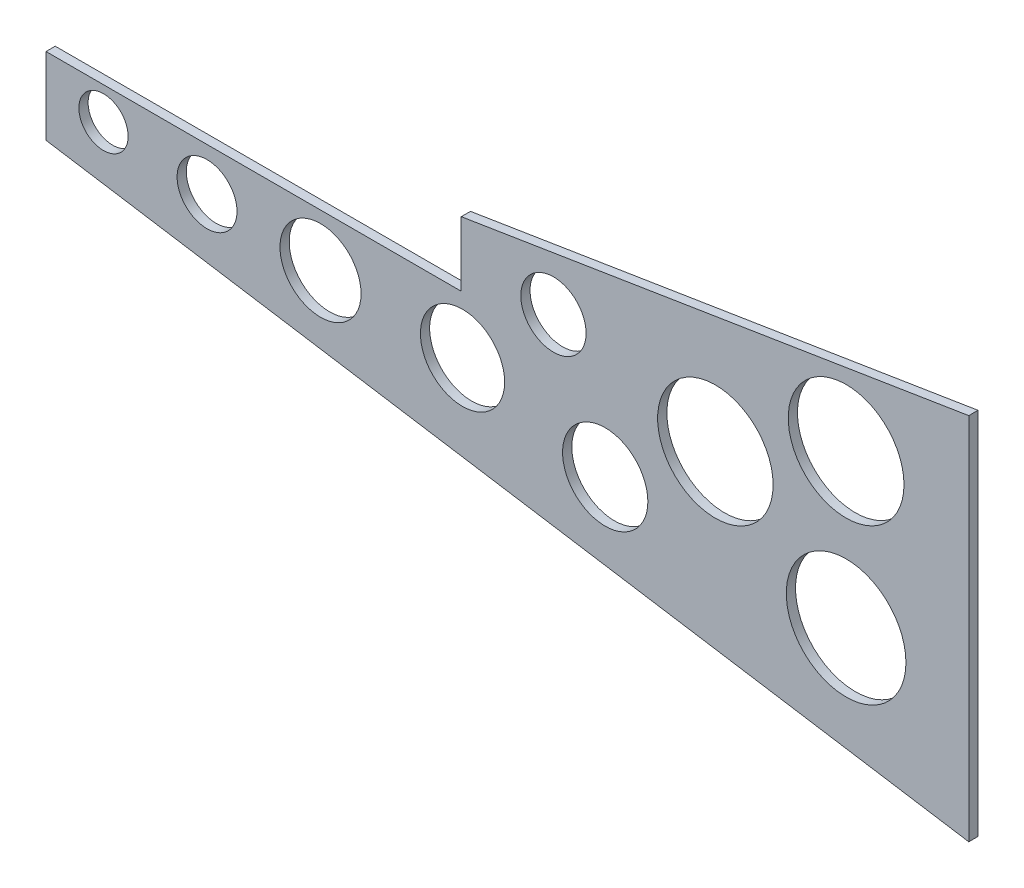
ISO-10303-21;
HEADER;
FILE_DESCRIPTION(('STEP AP214'),'2;1');
FILE_NAME('part.step','',(''),(''),'','','');
FILE_SCHEMA(('AUTOMOTIVE_DESIGN { 1 0 10303 214 1 1 1 1 }'));
ENDSEC;
DATA;
#1=APPLICATION_CONTEXT('core data for automotive mechanical design processes');
#2=APPLICATION_PROTOCOL_DEFINITION('international standard','automotive_design',2000,#1);
#3=PRODUCT_CONTEXT('',#1,'mechanical');
#4=PRODUCT('Part','Part','',(#3));
#5=PRODUCT_RELATED_PRODUCT_CATEGORY('part','',(#4));
#6=PRODUCT_DEFINITION_FORMATION('','',#4);
#7=PRODUCT_DEFINITION_CONTEXT('part definition',#1,'design');
#8=PRODUCT_DEFINITION('design','',#6,#7);
#9=PRODUCT_DEFINITION_SHAPE('','',#8);
#10=(LENGTH_UNIT() NAMED_UNIT(*) SI_UNIT(.MILLI.,.METRE.));
#11=(NAMED_UNIT(*) PLANE_ANGLE_UNIT() SI_UNIT($,.RADIAN.));
#12=(NAMED_UNIT(*) SI_UNIT($,.STERADIAN.) SOLID_ANGLE_UNIT());
#13=UNCERTAINTY_MEASURE_WITH_UNIT(LENGTH_MEASURE(1.E-05),#10,'distance_accuracy_value','');
#14=(GEOMETRIC_REPRESENTATION_CONTEXT(3) GLOBAL_UNCERTAINTY_ASSIGNED_CONTEXT((#13)) GLOBAL_UNIT_ASSIGNED_CONTEXT((#10,
#11,#12)) REPRESENTATION_CONTEXT('',''));
#15=CARTESIAN_POINT('',(0.,0.,0.));
#16=DIRECTION('',(0.,0.,1.));
#17=DIRECTION('',(1.,0.,0.));
#18=AXIS2_PLACEMENT_3D('',#15,#16,#17);
#19=CARTESIAN_POINT('',(-15.,30.1193027020137,3.));
#20=DIRECTION('',(0.158484488240427,-0.987361467238402,0.));
#21=DIRECTION('',(0.987361467238402,0.158484488240427,0.));
#22=AXIS2_PLACEMENT_3D('',#19,#20,#21);
#23=PLANE('',#22);
#24=DIRECTION('',(-0.987361467238402,-0.158484488240427,0.));
#25=VECTOR('',#24,1.);
#26=CARTESIAN_POINT('',(-15.,30.1193027020137,0.));
#27=LINE('',#26,#25);
#28=CARTESIAN_POINT('',(150.,56.6039706046516,0.));
#29=VERTEX_POINT('',#28);
#30=CARTESIAN_POINT('',(-15.,30.1193027020137,0.));
#31=VERTEX_POINT('',#30);
#32=EDGE_CURVE('E132',#29,#31,#27,.T.);
#33=ORIENTED_EDGE('',*,*,#32,.T.);
#34=DIRECTION('',(0.,0.,-1.));
#35=VECTOR('',#34,1.);
#36=CARTESIAN_POINT('',(-15.,30.1193027020137,3.));
#37=LINE('',#36,#35);
#38=CARTESIAN_POINT('',(-15.,30.1193027020137,3.));
#39=VERTEX_POINT('',#38);
#40=EDGE_CURVE('E11',#39,#31,#37,.T.);
#41=ORIENTED_EDGE('',*,*,#40,.F.);
#42=DIRECTION('',(-0.987361467238402,-0.158484488240427,0.));
#43=VECTOR('',#42,1.);
#44=CARTESIAN_POINT('',(-15.,30.1193027020137,3.));
#45=LINE('',#44,#43);
#46=CARTESIAN_POINT('',(150.,56.6039706046516,3.));
#47=VERTEX_POINT('',#46);
#48=EDGE_CURVE('E149',#47,#39,#45,.T.);
#49=ORIENTED_EDGE('',*,*,#48,.F.);
#50=DIRECTION('',(0.,0.,-1.));
#51=VECTOR('',#50,1.);
#52=CARTESIAN_POINT('',(150.,56.6039706046516,3.));
#53=LINE('',#52,#51);
#54=EDGE_CURVE('E128',#47,#29,#53,.T.);
#55=ORIENTED_EDGE('',*,*,#54,.T.);
#56=EDGE_LOOP('',(#33,#41,#49,#55));
#57=FACE_BOUND('',#56,.T.);
#58=ADVANCED_FACE('F43',(#57),#23,.F.);
#59=CARTESIAN_POINT('',(-15.,9.11930270201369,3.));
#60=DIRECTION('',(1.,0.,0.));
#61=DIRECTION('',(0.,0.,-1.));
#62=AXIS2_PLACEMENT_3D('',#59,#60,#61);
#63=PLANE('',#62);
#64=DIRECTION('',(0.,-1.,0.));
#65=VECTOR('',#64,1.);
#66=CARTESIAN_POINT('',(-15.,9.11930270201369,0.));
#67=LINE('',#66,#65);
#68=CARTESIAN_POINT('',(-15.,9.11930270201369,0.));
#69=VERTEX_POINT('',#68);
#70=EDGE_CURVE('E136',#31,#69,#67,.T.);
#71=ORIENTED_EDGE('',*,*,#70,.T.);
#72=DIRECTION('',(0.,0.,-1.));
#73=VECTOR('',#72,1.);
#74=CARTESIAN_POINT('',(-15.,9.11930270201369,3.));
#75=LINE('',#74,#73);
#76=CARTESIAN_POINT('',(-15.,9.11930270201369,3.));
#77=VERTEX_POINT('',#76);
#78=EDGE_CURVE('E52',#77,#69,#75,.T.);
#79=ORIENTED_EDGE('',*,*,#78,.F.);
#80=DIRECTION('',(0.,-1.,0.));
#81=VECTOR('',#80,1.);
#82=CARTESIAN_POINT('',(-15.,9.11930270201369,3.));
#83=LINE('',#82,#81);
#84=EDGE_CURVE('E97',#39,#77,#83,.T.);
#85=ORIENTED_EDGE('',*,*,#84,.F.);
#86=ORIENTED_EDGE('',*,*,#40,.T.);
#87=EDGE_LOOP('',(#71,#79,#85,#86));
#88=FACE_BOUND('',#87,.T.);
#89=ADVANCED_FACE('F178',(#88),#63,.F.);
#90=CARTESIAN_POINT('',(-150.,9.11930270201369,3.));
#91=DIRECTION('',(0.,-1.,0.));
#92=DIRECTION('',(0.,0.,-1.));
#93=AXIS2_PLACEMENT_3D('',#90,#91,#92);
#94=PLANE('',#93);
#95=DIRECTION('',(-1.,0.,0.));
#96=VECTOR('',#95,1.);
#97=CARTESIAN_POINT('',(-150.,9.11930270201369,0.));
#98=LINE('',#97,#96);
#99=CARTESIAN_POINT('',(-150.,9.11930270201369,0.));
#100=VERTEX_POINT('',#99);
#101=EDGE_CURVE('E140',#69,#100,#98,.T.);
#102=ORIENTED_EDGE('',*,*,#101,.T.);
#103=DIRECTION('',(0.,0.,-1.));
#104=VECTOR('',#103,1.);
#105=CARTESIAN_POINT('',(-150.,9.11930270201369,3.));
#106=LINE('',#105,#104);
#107=CARTESIAN_POINT('',(-150.,9.11930270201369,3.));
#108=VERTEX_POINT('',#107);
#109=EDGE_CURVE('E121',#108,#100,#106,.T.);
#110=ORIENTED_EDGE('',*,*,#109,.F.);
#111=DIRECTION('',(-1.,0.,0.));
#112=VECTOR('',#111,1.);
#113=CARTESIAN_POINT('',(-150.,9.11930270201369,3.));
#114=LINE('',#113,#112);
#115=EDGE_CURVE('E110',#77,#108,#114,.T.);
#116=ORIENTED_EDGE('',*,*,#115,.F.);
#117=ORIENTED_EDGE('',*,*,#78,.T.);
#118=EDGE_LOOP('',(#102,#110,#116,#117));
#119=FACE_BOUND('',#118,.T.);
#120=ADVANCED_FACE('F159',(#119),#94,.F.);
#121=CARTESIAN_POINT('',(-150.,-15.8806972979863,3.));
#122=DIRECTION('',(1.,0.,0.));
#123=DIRECTION('',(0.,1.,0.));
#124=AXIS2_PLACEMENT_3D('',#121,#122,#123);
#125=PLANE('',#124);
#126=DIRECTION('',(0.,-1.,0.));
#127=VECTOR('',#126,1.);
#128=CARTESIAN_POINT('',(-150.,-15.8806972979863,0.));
#129=LINE('',#128,#127);
#130=CARTESIAN_POINT('',(-150.,-15.8806972979863,0.));
#131=VERTEX_POINT('',#130);
#132=EDGE_CURVE('E119',#100,#131,#129,.T.);
#133=ORIENTED_EDGE('',*,*,#132,.T.);
#134=DIRECTION('',(0.,0.,-1.));
#135=VECTOR('',#134,1.);
#136=CARTESIAN_POINT('',(-150.,-15.8806972979863,3.));
#137=LINE('',#136,#135);
#138=CARTESIAN_POINT('',(-150.,-15.8806972979863,3.));
#139=VERTEX_POINT('',#138);
#140=EDGE_CURVE('E116',#139,#131,#137,.T.);
#141=ORIENTED_EDGE('',*,*,#140,.F.);
#142=DIRECTION('',(0.,-1.,0.));
#143=VECTOR('',#142,1.);
#144=CARTESIAN_POINT('',(-150.,-15.8806972979863,3.));
#145=LINE('',#144,#143);
#146=EDGE_CURVE('E104',#108,#139,#145,.T.);
#147=ORIENTED_EDGE('',*,*,#146,.F.);
#148=ORIENTED_EDGE('',*,*,#109,.T.);
#149=EDGE_LOOP('',(#133,#141,#147,#148));
#150=FACE_BOUND('',#149,.T.);
#151=ADVANCED_FACE('F117',(#150),#125,.F.);
#152=CARTESIAN_POINT('',(150.,-63.3960293953484,3.));
#153=DIRECTION('',(0.156434465040235,0.987688340595137,0.));
#154=DIRECTION('',(-0.987688340595137,0.156434465040235,0.));
#155=AXIS2_PLACEMENT_3D('',#152,#153,#154);
#156=PLANE('',#155);
#157=DIRECTION('',(0.987688340595137,-0.156434465040235,0.));
#158=VECTOR('',#157,1.);
#159=CARTESIAN_POINT('',(150.,-63.3960293953484,0.));
#160=LINE('',#159,#158);
#161=CARTESIAN_POINT('',(150.,-63.3960293953484,0.));
#162=VERTEX_POINT('',#161);
#163=EDGE_CURVE('E83',#131,#162,#160,.T.);
#164=ORIENTED_EDGE('',*,*,#163,.T.);
#165=DIRECTION('',(0.,0.,-1.));
#166=VECTOR('',#165,1.);
#167=CARTESIAN_POINT('',(150.,-63.3960293953484,3.));
#168=LINE('',#167,#166);
#169=CARTESIAN_POINT('',(150.,-63.3960293953484,3.));
#170=VERTEX_POINT('',#169);
#171=EDGE_CURVE('E122',#170,#162,#168,.T.);
#172=ORIENTED_EDGE('',*,*,#171,.F.);
#173=DIRECTION('',(0.987688340595137,-0.156434465040235,0.));
#174=VECTOR('',#173,1.);
#175=CARTESIAN_POINT('',(150.,-63.3960293953484,3.));
#176=LINE('',#175,#174);
#177=EDGE_CURVE('E108',#139,#170,#176,.T.);
#178=ORIENTED_EDGE('',*,*,#177,.F.);
#179=ORIENTED_EDGE('',*,*,#140,.T.);
#180=EDGE_LOOP('',(#164,#172,#178,#179));
#181=FACE_BOUND('',#180,.T.);
#182=ADVANCED_FACE('F124',(#181),#156,.F.);
#183=CARTESIAN_POINT('',(150.,56.6039706046516,3.));
#184=DIRECTION('',(-1.,0.,0.));
#185=DIRECTION('',(0.,-1.,0.));
#186=AXIS2_PLACEMENT_3D('',#183,#184,#185);
#187=PLANE('',#186);
#188=DIRECTION('',(0.,1.,0.));
#189=VECTOR('',#188,1.);
#190=CARTESIAN_POINT('',(150.,56.6039706046516,0.));
#191=LINE('',#190,#189);
#192=EDGE_CURVE('E89',#162,#29,#191,.T.);
#193=ORIENTED_EDGE('',*,*,#192,.T.);
#194=ORIENTED_EDGE('',*,*,#54,.F.);
#195=DIRECTION('',(0.,1.,0.));
#196=VECTOR('',#195,1.);
#197=CARTESIAN_POINT('',(150.,56.6039706046516,3.));
#198=LINE('',#197,#196);
#199=EDGE_CURVE('E60',#170,#47,#198,.T.);
#200=ORIENTED_EDGE('',*,*,#199,.F.);
#201=ORIENTED_EDGE('',*,*,#171,.T.);
#202=EDGE_LOOP('',(#193,#194,#200,#201));
#203=FACE_BOUND('',#202,.T.);
#204=ADVANCED_FACE('F166',(#203),#187,.F.);
#205=CARTESIAN_POINT('',(0.,0.,3.));
#206=DIRECTION('',(0.,0.,-1.));
#207=DIRECTION('',(-1.,0.,0.));
#208=AXIS2_PLACEMENT_3D('',#205,#206,#207);
#209=PLANE('',#208);
#210=CARTESIAN_POINT('',(-131.306408305619,-1.41889154507243,3.));
#211=DIRECTION('',(0.,0.,1.));
#212=DIRECTION('',(1.,0.,0.));
#213=AXIS2_PLACEMENT_3D('',#210,#211,#212);
#214=CIRCLE('',#213,8.00618735657102);
#215=CARTESIAN_POINT('',(-123.300220949048,-1.41889154507243,3.));
#216=VERTEX_POINT('',#215);
#217=EDGE_CURVE('E361',#216,#216,#214,.T.);
#218=ORIENTED_EDGE('',*,*,#217,.F.);
#219=EDGE_LOOP('',(#218));
#220=FACE_BOUND('',#219,.T.);
#221=CARTESIAN_POINT('',(14.9747776805711,17.5674570785039,3.));
#222=DIRECTION('',(0.,0.,1.));
#223=DIRECTION('',(1.,0.,0.));
#224=AXIS2_PLACEMENT_3D('',#221,#222,#223);
#225=CIRCLE('',#224,10.6136915417065);
#226=CARTESIAN_POINT('',(25.5884692222777,17.5674570785039,3.));
#227=VERTEX_POINT('',#226);
#228=EDGE_CURVE('E397',#227,#227,#225,.T.);
#229=ORIENTED_EDGE('',*,*,#228,.F.);
#230=EDGE_LOOP('',(#229));
#231=FACE_BOUND('',#230,.T.);
#232=CARTESIAN_POINT('',(31.803586687832,-19.7579782837541,3.));
#233=DIRECTION('',(0.,0.,1.));
#234=DIRECTION('',(1.,0.,0.));
#235=AXIS2_PLACEMENT_3D('',#232,#233,#234);
#236=CIRCLE('',#235,13.8637660259265);
#237=CARTESIAN_POINT('',(45.6673527137584,-19.7579782837541,3.));
#238=VERTEX_POINT('',#237);
#239=EDGE_CURVE('E389',#238,#238,#236,.T.);
#240=ORIENTED_EDGE('',*,*,#239,.F.);
#241=EDGE_LOOP('',(#240));
#242=FACE_BOUND('',#241,.T.);
#243=CARTESIAN_POINT('',(67.618744318669,5.29068588450728,3.));
#244=DIRECTION('',(0.,0.,1.));
#245=DIRECTION('',(1.,0.,0.));
#246=AXIS2_PLACEMENT_3D('',#243,#244,#245);
#247=CIRCLE('',#246,18.7705946619448);
#248=CARTESIAN_POINT('',(86.3893389806138,5.29068588450728,3.));
#249=VERTEX_POINT('',#248);
#250=EDGE_CURVE('E381',#249,#249,#247,.T.);
#251=ORIENTED_EDGE('',*,*,#250,.F.);
#252=EDGE_LOOP('',(#251));
#253=FACE_BOUND('',#252,.T.);
#254=CARTESIAN_POINT('',(110.122274760084,26.6291234670289,3.));
#255=DIRECTION('',(0.,0.,1.));
#256=DIRECTION('',(1.,0.,0.));
#257=AXIS2_PLACEMENT_3D('',#254,#255,#256);
#258=CIRCLE('',#257,18.8139433926442);
#259=CARTESIAN_POINT('',(128.936218152728,26.6291234670289,3.));
#260=VERTEX_POINT('',#259);
#261=EDGE_CURVE('E372',#260,#260,#258,.T.);
#262=ORIENTED_EDGE('',*,*,#261,.F.);
#263=EDGE_LOOP('',(#262));
#264=FACE_BOUND('',#263,.T.);
#265=CARTESIAN_POINT('',(110.122274760084,-23.1164765092135,3.));
#266=DIRECTION('',(0.,0.,1.));
#267=DIRECTION('',(1.,0.,0.));
#268=AXIS2_PLACEMENT_3D('',#265,#266,#267);
#269=CIRCLE('',#268,19.4507710963909);
#270=CARTESIAN_POINT('',(129.573045856475,-23.1164765092135,3.));
#271=VERTEX_POINT('',#270);
#272=EDGE_CURVE('E424',#271,#271,#269,.T.);
#273=ORIENTED_EDGE('',*,*,#272,.F.);
#274=EDGE_LOOP('',(#273));
#275=FACE_BOUND('',#274,.T.);
#276=CARTESIAN_POINT('',(-14.5835150629511,-9.42507890164345,3.));
#277=DIRECTION('',(0.,0.,1.));
#278=DIRECTION('',(1.,0.,0.));
#279=AXIS2_PLACEMENT_3D('',#276,#277,#278);
#280=CIRCLE('',#279,13.69139760757);
#281=CARTESIAN_POINT('',(-0.892117455381047,-9.42507890164345,3.));
#282=VERTEX_POINT('',#281);
#283=EDGE_CURVE('E416',#282,#282,#280,.T.);
#284=ORIENTED_EDGE('',*,*,#283,.F.);
#285=EDGE_LOOP('',(#284));
#286=FACE_BOUND('',#285,.T.);
#287=CARTESIAN_POINT('',(-60.7548628521025,-7.89151039401888,3.));
#288=DIRECTION('',(0.,0.,1.));
#289=DIRECTION('',(1.,0.,0.));
#290=AXIS2_PLACEMENT_3D('',#287,#288,#289);
#291=CIRCLE('',#290,13.1821962785262);
#292=CARTESIAN_POINT('',(-47.5726665735763,-7.89151039401888,3.));
#293=VERTEX_POINT('',#292);
#294=EDGE_CURVE('E408',#293,#293,#291,.T.);
#295=ORIENTED_EDGE('',*,*,#294,.F.);
#296=EDGE_LOOP('',(#295));
#297=FACE_BOUND('',#296,.T.);
#298=CARTESIAN_POINT('',(-97.6487902910974,-4.87095493117722,3.));
#299=DIRECTION('',(0.,0.,1.));
#300=DIRECTION('',(1.,0.,0.));
#301=AXIS2_PLACEMENT_3D('',#298,#299,#300);
#302=CIRCLE('',#301,9.73526248798489);
#303=CARTESIAN_POINT('',(-87.9135278031125,-4.87095493117722,3.));
#304=VERTEX_POINT('',#303);
#305=EDGE_CURVE('E363',#304,#304,#302,.T.);
#306=ORIENTED_EDGE('',*,*,#305,.F.);
#307=EDGE_LOOP('',(#306));
#308=FACE_BOUND('',#307,.T.);
#309=ORIENTED_EDGE('',*,*,#48,.T.);
#310=ORIENTED_EDGE('',*,*,#84,.T.);
#311=ORIENTED_EDGE('',*,*,#115,.T.);
#312=ORIENTED_EDGE('',*,*,#146,.T.);
#313=ORIENTED_EDGE('',*,*,#177,.T.);
#314=ORIENTED_EDGE('',*,*,#199,.T.);
#315=EDGE_LOOP('',(#309,#310,#311,#312,#313,#314));
#316=FACE_BOUND('',#315,.T.);
#317=ADVANCED_FACE('F106',(#220,#231,#242,#253,#264,#275,#286,#297,#308,#316),#209,.F.);
#318=CARTESIAN_POINT('',(0.,0.,0.));
#319=DIRECTION('',(0.,0.,-1.));
#320=DIRECTION('',(-1.,0.,0.));
#321=AXIS2_PLACEMENT_3D('',#318,#319,#320);
#322=PLANE('',#321);
#323=CARTESIAN_POINT('',(-131.306408305619,-1.41889154507243,0.));
#324=DIRECTION('',(0.,0.,1.));
#325=DIRECTION('',(1.,0.,0.));
#326=AXIS2_PLACEMENT_3D('',#323,#324,#325);
#327=CIRCLE('',#326,8.00618735657102);
#328=CARTESIAN_POINT('',(-123.300220949048,-1.41889154507243,0.));
#329=VERTEX_POINT('',#328);
#330=EDGE_CURVE('E137',#329,#329,#327,.T.);
#331=ORIENTED_EDGE('',*,*,#330,.T.);
#332=EDGE_LOOP('',(#331));
#333=FACE_BOUND('',#332,.T.);
#334=CARTESIAN_POINT('',(14.9747776805711,17.5674570785039,0.));
#335=DIRECTION('',(0.,0.,1.));
#336=DIRECTION('',(1.,0.,0.));
#337=AXIS2_PLACEMENT_3D('',#334,#335,#336);
#338=CIRCLE('',#337,10.6136915417065);
#339=CARTESIAN_POINT('',(25.5884692222777,17.5674570785039,0.));
#340=VERTEX_POINT('',#339);
#341=EDGE_CURVE('E401',#340,#340,#338,.T.);
#342=ORIENTED_EDGE('',*,*,#341,.T.);
#343=EDGE_LOOP('',(#342));
#344=FACE_BOUND('',#343,.T.);
#345=CARTESIAN_POINT('',(31.803586687832,-19.7579782837541,0.));
#346=DIRECTION('',(0.,0.,1.));
#347=DIRECTION('',(1.,0.,0.));
#348=AXIS2_PLACEMENT_3D('',#345,#346,#347);
#349=CIRCLE('',#348,13.8637660259265);
#350=CARTESIAN_POINT('',(45.6673527137584,-19.7579782837541,0.));
#351=VERTEX_POINT('',#350);
#352=EDGE_CURVE('E393',#351,#351,#349,.T.);
#353=ORIENTED_EDGE('',*,*,#352,.T.);
#354=EDGE_LOOP('',(#353));
#355=FACE_BOUND('',#354,.T.);
#356=CARTESIAN_POINT('',(67.618744318669,5.29068588450728,0.));
#357=DIRECTION('',(0.,0.,1.));
#358=DIRECTION('',(1.,0.,0.));
#359=AXIS2_PLACEMENT_3D('',#356,#357,#358);
#360=CIRCLE('',#359,18.7705946619448);
#361=CARTESIAN_POINT('',(86.3893389806138,5.29068588450728,0.));
#362=VERTEX_POINT('',#361);
#363=EDGE_CURVE('E385',#362,#362,#360,.T.);
#364=ORIENTED_EDGE('',*,*,#363,.T.);
#365=EDGE_LOOP('',(#364));
#366=FACE_BOUND('',#365,.T.);
#367=CARTESIAN_POINT('',(110.122274760084,26.6291234670289,0.));
#368=DIRECTION('',(0.,0.,1.));
#369=DIRECTION('',(1.,0.,0.));
#370=AXIS2_PLACEMENT_3D('',#367,#368,#369);
#371=CIRCLE('',#370,18.8139433926442);
#372=CARTESIAN_POINT('',(128.936218152728,26.6291234670289,0.));
#373=VERTEX_POINT('',#372);
#374=EDGE_CURVE('E377',#373,#373,#371,.T.);
#375=ORIENTED_EDGE('',*,*,#374,.T.);
#376=EDGE_LOOP('',(#375));
#377=FACE_BOUND('',#376,.T.);
#378=CARTESIAN_POINT('',(110.122274760084,-23.1164765092135,0.));
#379=DIRECTION('',(0.,0.,1.));
#380=DIRECTION('',(1.,0.,0.));
#381=AXIS2_PLACEMENT_3D('',#378,#379,#380);
#382=CIRCLE('',#381,19.4507710963909);
#383=CARTESIAN_POINT('',(129.573045856475,-23.1164765092135,0.));
#384=VERTEX_POINT('',#383);
#385=EDGE_CURVE('E376',#384,#384,#382,.T.);
#386=ORIENTED_EDGE('',*,*,#385,.T.);
#387=EDGE_LOOP('',(#386));
#388=FACE_BOUND('',#387,.T.);
#389=CARTESIAN_POINT('',(-14.5835150629511,-9.42507890164345,0.));
#390=DIRECTION('',(0.,0.,1.));
#391=DIRECTION('',(1.,0.,0.));
#392=AXIS2_PLACEMENT_3D('',#389,#390,#391);
#393=CIRCLE('',#392,13.69139760757);
#394=CARTESIAN_POINT('',(-0.892117455381047,-9.42507890164345,0.));
#395=VERTEX_POINT('',#394);
#396=EDGE_CURVE('E420',#395,#395,#393,.T.);
#397=ORIENTED_EDGE('',*,*,#396,.T.);
#398=EDGE_LOOP('',(#397));
#399=FACE_BOUND('',#398,.T.);
#400=CARTESIAN_POINT('',(-60.7548628521025,-7.89151039401888,0.));
#401=DIRECTION('',(0.,0.,1.));
#402=DIRECTION('',(1.,0.,0.));
#403=AXIS2_PLACEMENT_3D('',#400,#401,#402);
#404=CIRCLE('',#403,13.1821962785262);
#405=CARTESIAN_POINT('',(-47.5726665735763,-7.89151039401888,0.));
#406=VERTEX_POINT('',#405);
#407=EDGE_CURVE('E412',#406,#406,#404,.T.);
#408=ORIENTED_EDGE('',*,*,#407,.T.);
#409=EDGE_LOOP('',(#408));
#410=FACE_BOUND('',#409,.T.);
#411=CARTESIAN_POINT('',(-97.6487902910974,-4.87095493117722,0.));
#412=DIRECTION('',(0.,0.,1.));
#413=DIRECTION('',(1.,0.,0.));
#414=AXIS2_PLACEMENT_3D('',#411,#412,#413);
#415=CIRCLE('',#414,9.73526248798489);
#416=CARTESIAN_POINT('',(-87.9135278031125,-4.87095493117722,0.));
#417=VERTEX_POINT('',#416);
#418=EDGE_CURVE('E369',#417,#417,#415,.T.);
#419=ORIENTED_EDGE('',*,*,#418,.T.);
#420=EDGE_LOOP('',(#419));
#421=FACE_BOUND('',#420,.T.);
#422=ORIENTED_EDGE('',*,*,#32,.F.);
#423=ORIENTED_EDGE('',*,*,#192,.F.);
#424=ORIENTED_EDGE('',*,*,#163,.F.);
#425=ORIENTED_EDGE('',*,*,#132,.F.);
#426=ORIENTED_EDGE('',*,*,#101,.F.);
#427=ORIENTED_EDGE('',*,*,#70,.F.);
#428=EDGE_LOOP('',(#422,#423,#424,#425,#426,#427));
#429=FACE_BOUND('',#428,.T.);
#430=ADVANCED_FACE('F162',(#333,#344,#355,#366,#377,#388,#399,#410,#421,#429),#322,.T.);
#431=CARTESIAN_POINT('',(-97.6487902910974,-4.87095493117722,0.));
#432=DIRECTION('',(0.,0.,1.));
#433=DIRECTION('',(1.,0.,0.));
#434=AXIS2_PLACEMENT_3D('',#431,#432,#433);
#435=CYLINDRICAL_SURFACE('',#434,9.73526248798489);
#436=ORIENTED_EDGE('',*,*,#418,.F.);
#437=EDGE_LOOP('',(#436));
#438=FACE_BOUND('',#437,.T.);
#439=ORIENTED_EDGE('',*,*,#305,.T.);
#440=EDGE_LOOP('',(#439));
#441=FACE_BOUND('',#440,.T.);
#442=ADVANCED_FACE('F218',(#438,#441),#435,.F.);
#443=CARTESIAN_POINT('',(-60.7548628521025,-7.89151039401888,0.));
#444=DIRECTION('',(0.,0.,1.));
#445=DIRECTION('',(1.,0.,0.));
#446=AXIS2_PLACEMENT_3D('',#443,#444,#445);
#447=CYLINDRICAL_SURFACE('',#446,13.1821962785262);
#448=ORIENTED_EDGE('',*,*,#407,.F.);
#449=EDGE_LOOP('',(#448));
#450=FACE_BOUND('',#449,.T.);
#451=ORIENTED_EDGE('',*,*,#294,.T.);
#452=EDGE_LOOP('',(#451));
#453=FACE_BOUND('',#452,.T.);
#454=ADVANCED_FACE('F228',(#450,#453),#447,.F.);
#455=CARTESIAN_POINT('',(-14.5835150629511,-9.42507890164345,0.));
#456=DIRECTION('',(0.,0.,1.));
#457=DIRECTION('',(1.,0.,0.));
#458=AXIS2_PLACEMENT_3D('',#455,#456,#457);
#459=CYLINDRICAL_SURFACE('',#458,13.69139760757);
#460=ORIENTED_EDGE('',*,*,#396,.F.);
#461=EDGE_LOOP('',(#460));
#462=FACE_BOUND('',#461,.T.);
#463=ORIENTED_EDGE('',*,*,#283,.T.);
#464=EDGE_LOOP('',(#463));
#465=FACE_BOUND('',#464,.T.);
#466=ADVANCED_FACE('F239',(#462,#465),#459,.F.);
#467=CARTESIAN_POINT('',(110.122274760084,-23.1164765092135,0.));
#468=DIRECTION('',(0.,0.,1.));
#469=DIRECTION('',(1.,0.,0.));
#470=AXIS2_PLACEMENT_3D('',#467,#468,#469);
#471=CYLINDRICAL_SURFACE('',#470,19.4507710963909);
#472=ORIENTED_EDGE('',*,*,#385,.F.);
#473=EDGE_LOOP('',(#472));
#474=FACE_BOUND('',#473,.T.);
#475=ORIENTED_EDGE('',*,*,#272,.T.);
#476=EDGE_LOOP('',(#475));
#477=FACE_BOUND('',#476,.T.);
#478=ADVANCED_FACE('F250',(#474,#477),#471,.F.);
#479=CARTESIAN_POINT('',(110.122274760084,26.6291234670289,0.));
#480=DIRECTION('',(0.,0.,1.));
#481=DIRECTION('',(1.,0.,0.));
#482=AXIS2_PLACEMENT_3D('',#479,#480,#481);
#483=CYLINDRICAL_SURFACE('',#482,18.8139433926442);
#484=ORIENTED_EDGE('',*,*,#374,.F.);
#485=EDGE_LOOP('',(#484));
#486=FACE_BOUND('',#485,.T.);
#487=ORIENTED_EDGE('',*,*,#261,.T.);
#488=EDGE_LOOP('',(#487));
#489=FACE_BOUND('',#488,.T.);
#490=ADVANCED_FACE('F261',(#486,#489),#483,.F.);
#491=CARTESIAN_POINT('',(67.618744318669,5.29068588450728,0.));
#492=DIRECTION('',(0.,0.,1.));
#493=DIRECTION('',(1.,0.,0.));
#494=AXIS2_PLACEMENT_3D('',#491,#492,#493);
#495=CYLINDRICAL_SURFACE('',#494,18.7705946619448);
#496=ORIENTED_EDGE('',*,*,#363,.F.);
#497=EDGE_LOOP('',(#496));
#498=FACE_BOUND('',#497,.T.);
#499=ORIENTED_EDGE('',*,*,#250,.T.);
#500=EDGE_LOOP('',(#499));
#501=FACE_BOUND('',#500,.T.);
#502=ADVANCED_FACE('F272',(#498,#501),#495,.F.);
#503=CARTESIAN_POINT('',(31.803586687832,-19.7579782837541,0.));
#504=DIRECTION('',(0.,0.,1.));
#505=DIRECTION('',(1.,0.,0.));
#506=AXIS2_PLACEMENT_3D('',#503,#504,#505);
#507=CYLINDRICAL_SURFACE('',#506,13.8637660259265);
#508=ORIENTED_EDGE('',*,*,#352,.F.);
#509=EDGE_LOOP('',(#508));
#510=FACE_BOUND('',#509,.T.);
#511=ORIENTED_EDGE('',*,*,#239,.T.);
#512=EDGE_LOOP('',(#511));
#513=FACE_BOUND('',#512,.T.);
#514=ADVANCED_FACE('F283',(#510,#513),#507,.F.);
#515=CARTESIAN_POINT('',(14.9747776805711,17.5674570785039,0.));
#516=DIRECTION('',(0.,0.,1.));
#517=DIRECTION('',(1.,0.,0.));
#518=AXIS2_PLACEMENT_3D('',#515,#516,#517);
#519=CYLINDRICAL_SURFACE('',#518,10.6136915417065);
#520=ORIENTED_EDGE('',*,*,#341,.F.);
#521=EDGE_LOOP('',(#520));
#522=FACE_BOUND('',#521,.T.);
#523=ORIENTED_EDGE('',*,*,#228,.T.);
#524=EDGE_LOOP('',(#523));
#525=FACE_BOUND('',#524,.T.);
#526=ADVANCED_FACE('F294',(#522,#525),#519,.F.);
#527=CARTESIAN_POINT('',(-131.306408305619,-1.41889154507243,0.));
#528=DIRECTION('',(0.,0.,1.));
#529=DIRECTION('',(1.,0.,0.));
#530=AXIS2_PLACEMENT_3D('',#527,#528,#529);
#531=CYLINDRICAL_SURFACE('',#530,8.00618735657102);
#532=ORIENTED_EDGE('',*,*,#330,.F.);
#533=EDGE_LOOP('',(#532));
#534=FACE_BOUND('',#533,.T.);
#535=ORIENTED_EDGE('',*,*,#217,.T.);
#536=EDGE_LOOP('',(#535));
#537=FACE_BOUND('',#536,.T.);
#538=ADVANCED_FACE('F305',(#534,#537),#531,.F.);
#539=CLOSED_SHELL('',(#58,#89,#120,#151,#182,#204,#317,#430,#442,#454,#466,#478,#490,#502,#514,
#526,#538));
#540=MANIFOLD_SOLID_BREP('B2',#539);
#541=ADVANCED_BREP_SHAPE_REPRESENTATION('',(#18,#540),#14);
#542=SHAPE_DEFINITION_REPRESENTATION(#9,#541);
ENDSEC;
END-ISO-10303-21;
